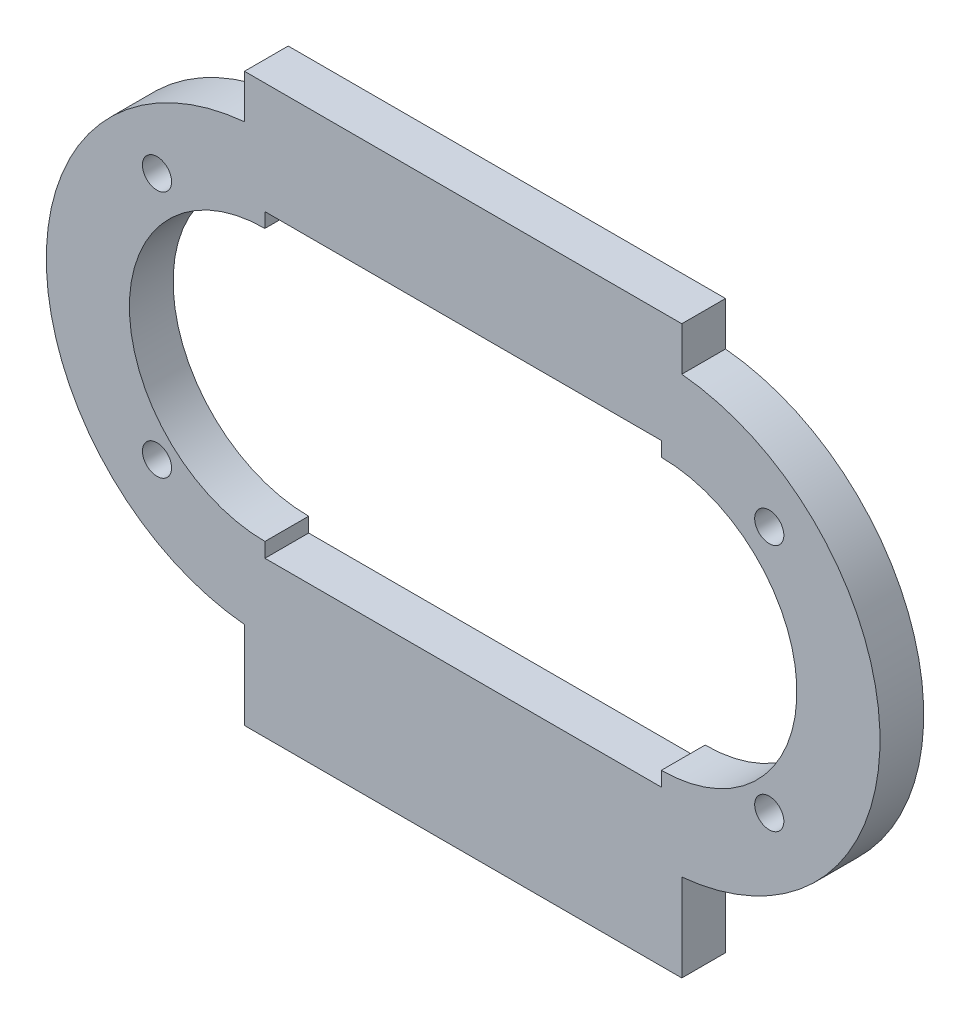
ISO-10303-21;
HEADER;
FILE_DESCRIPTION(('STEP AP214'),'2;1');
FILE_NAME('part.step','',(''),(''),'','','');
FILE_SCHEMA(('AUTOMOTIVE_DESIGN { 1 0 10303 214 1 1 1 1 }'));
ENDSEC;
DATA;
#1=APPLICATION_CONTEXT('core data for automotive mechanical design processes');
#2=APPLICATION_PROTOCOL_DEFINITION('international standard','automotive_design',2000,#1);
#3=PRODUCT_CONTEXT('',#1,'mechanical');
#4=PRODUCT('Part','Part','',(#3));
#5=PRODUCT_RELATED_PRODUCT_CATEGORY('part','',(#4));
#6=PRODUCT_DEFINITION_FORMATION('','',#4);
#7=PRODUCT_DEFINITION_CONTEXT('part definition',#1,'design');
#8=PRODUCT_DEFINITION('design','',#6,#7);
#9=PRODUCT_DEFINITION_SHAPE('','',#8);
#10=(LENGTH_UNIT() NAMED_UNIT(*) SI_UNIT(.MILLI.,.METRE.));
#11=(NAMED_UNIT(*) PLANE_ANGLE_UNIT() SI_UNIT($,.RADIAN.));
#12=(NAMED_UNIT(*) SI_UNIT($,.STERADIAN.) SOLID_ANGLE_UNIT());
#13=UNCERTAINTY_MEASURE_WITH_UNIT(LENGTH_MEASURE(1.E-05),#10,'distance_accuracy_value','');
#14=(GEOMETRIC_REPRESENTATION_CONTEXT(3) GLOBAL_UNCERTAINTY_ASSIGNED_CONTEXT((#13)) GLOBAL_UNIT_ASSIGNED_CONTEXT((#10,
#11,#12)) REPRESENTATION_CONTEXT('',''));
#15=CARTESIAN_POINT('',(0.,0.,0.));
#16=DIRECTION('',(0.,0.,1.));
#17=DIRECTION('',(1.,0.,0.));
#18=AXIS2_PLACEMENT_3D('',#15,#16,#17);
#19=CARTESIAN_POINT('',(27.1936662606577,0.,3.));
#20=DIRECTION('',(0.,0.,-1.));
#21=DIRECTION('',(-1.,0.,0.));
#22=AXIS2_PLACEMENT_3D('',#19,#20,#21);
#23=PLANE('',#22);
#24=DIRECTION('',(1.,0.,0.));
#25=VECTOR('',#24,1.);
#26=CARTESIAN_POINT('',(-1.40316686967113,-20.9342265529842,3.));
#27=LINE('',#26,#25);
#28=CARTESIAN_POINT('',(-1.40316686967113,-20.9342265529842,3.));
#29=VERTEX_POINT('',#28);
#30=CARTESIAN_POINT('',(28.5968331303289,-20.9342265529842,3.));
#31=VERTEX_POINT('',#30);
#32=EDGE_CURVE('E245',#29,#31,#27,.T.);
#33=ORIENTED_EDGE('',*,*,#32,.T.);
#34=DIRECTION('',(0.,1.,0.));
#35=VECTOR('',#34,1.);
#36=CARTESIAN_POINT('',(28.5968331303289,-20.9342265529842,3.));
#37=LINE('',#36,#35);
#38=CARTESIAN_POINT('',(28.5968331303289,-14.9342265529842,3.));
#39=VERTEX_POINT('',#38);
#40=EDGE_CURVE('E249',#31,#39,#37,.T.);
#41=ORIENTED_EDGE('',*,*,#40,.T.);
#42=CARTESIAN_POINT('',(27.1936662606577,0.,3.));
#43=DIRECTION('',(0.,0.,1.));
#44=DIRECTION('',(-1.,0.,0.));
#45=AXIS2_PLACEMENT_3D('',#42,#43,#44);
#46=CIRCLE('',#45,15.);
#47=CARTESIAN_POINT('',(28.5968331303289,14.9342265529842,3.));
#48=VERTEX_POINT('',#47);
#49=EDGE_CURVE('E253',#39,#48,#46,.T.);
#50=ORIENTED_EDGE('',*,*,#49,.T.);
#51=DIRECTION('',(0.,1.,0.));
#52=VECTOR('',#51,1.);
#53=CARTESIAN_POINT('',(28.5968331303289,17.9342265529842,3.));
#54=LINE('',#53,#52);
#55=CARTESIAN_POINT('',(28.5968331303289,17.9342265529842,3.));
#56=VERTEX_POINT('',#55);
#57=EDGE_CURVE('E256',#48,#56,#54,.T.);
#58=ORIENTED_EDGE('',*,*,#57,.T.);
#59=DIRECTION('',(-1.,0.,0.));
#60=VECTOR('',#59,1.);
#61=CARTESIAN_POINT('',(-1.40316686967113,17.9342265529842,3.));
#62=LINE('',#61,#60);
#63=CARTESIAN_POINT('',(-1.40316686967113,17.9342265529842,3.));
#64=VERTEX_POINT('',#63);
#65=EDGE_CURVE('E259',#56,#64,#62,.T.);
#66=ORIENTED_EDGE('',*,*,#65,.T.);
#67=DIRECTION('',(0.,-1.,0.));
#68=VECTOR('',#67,1.);
#69=CARTESIAN_POINT('',(-1.40316686967113,17.9342265529842,3.));
#70=LINE('',#69,#68);
#71=CARTESIAN_POINT('',(-1.40316686967113,14.9342265529842,3.));
#72=VERTEX_POINT('',#71);
#73=EDGE_CURVE('E262',#64,#72,#70,.T.);
#74=ORIENTED_EDGE('',*,*,#73,.T.);
#75=CARTESIAN_POINT('',(0.,0.,3.));
#76=DIRECTION('',(0.,0.,1.));
#77=DIRECTION('',(1.,0.,0.));
#78=AXIS2_PLACEMENT_3D('',#75,#76,#77);
#79=CIRCLE('',#78,15.);
#80=CARTESIAN_POINT('',(-1.40316686967113,-14.9342265529842,3.));
#81=VERTEX_POINT('',#80);
#82=EDGE_CURVE('E265',#72,#81,#79,.T.);
#83=ORIENTED_EDGE('',*,*,#82,.T.);
#84=DIRECTION('',(0.,-1.,0.));
#85=VECTOR('',#84,1.);
#86=CARTESIAN_POINT('',(-1.40316686967113,-20.9342265529842,3.));
#87=LINE('',#86,#85);
#88=EDGE_CURVE('E268',#81,#29,#87,.T.);
#89=ORIENTED_EDGE('',*,*,#88,.T.);
#90=EDGE_LOOP('',(#33,#41,#50,#58,#66,#74,#83,#89));
#91=FACE_BOUND('',#90,.T.);
#92=DIRECTION('',(-1.04325473838697E-13,-1.,0.));
#93=VECTOR('',#92,1.);
#94=CARTESIAN_POINT('',(0.,-9.29754169110126,3.));
#95=LINE('',#94,#93);
#96=CARTESIAN_POINT('',(0.,-9.29754169110126,3.));
#97=VERTEX_POINT('',#96);
#98=CARTESIAN_POINT('',(0.,-10.2975416911012,3.));
#99=VERTEX_POINT('',#98);
#100=EDGE_CURVE('E153',#97,#99,#95,.T.);
#101=ORIENTED_EDGE('',*,*,#100,.F.);
#102=CARTESIAN_POINT('',(0.,0.,3.));
#103=DIRECTION('',(0.,0.,1.));
#104=DIRECTION('',(1.,0.,0.));
#105=AXIS2_PLACEMENT_3D('',#102,#103,#104);
#106=CIRCLE('',#105,9.29754169110126);
#107=CARTESIAN_POINT('',(0.,9.29754169110126,3.));
#108=VERTEX_POINT('',#107);
#109=EDGE_CURVE('E196',#108,#97,#106,.T.);
#110=ORIENTED_EDGE('',*,*,#109,.F.);
#111=DIRECTION('',(0.,-1.,0.));
#112=VECTOR('',#111,1.);
#113=CARTESIAN_POINT('',(0.,10.2975416911012,3.));
#114=LINE('',#113,#112);
#115=CARTESIAN_POINT('',(0.,10.2975416911012,3.));
#116=VERTEX_POINT('',#115);
#117=EDGE_CURVE('E193',#116,#108,#114,.T.);
#118=ORIENTED_EDGE('',*,*,#117,.F.);
#119=DIRECTION('',(-1.,0.,0.));
#120=VECTOR('',#119,1.);
#121=CARTESIAN_POINT('',(0.,10.2975416911012,3.));
#122=LINE('',#121,#120);
#123=CARTESIAN_POINT('',(27.1936662606577,10.2975416911012,3.));
#124=VERTEX_POINT('',#123);
#125=EDGE_CURVE('E190',#124,#116,#122,.T.);
#126=ORIENTED_EDGE('',*,*,#125,.F.);
#127=DIRECTION('',(0.,1.,0.));
#128=VECTOR('',#127,1.);
#129=CARTESIAN_POINT('',(27.1936662606577,10.2975416911012,3.));
#130=LINE('',#129,#128);
#131=CARTESIAN_POINT('',(27.1936662606577,9.29754169110125,3.));
#132=VERTEX_POINT('',#131);
#133=EDGE_CURVE('E187',#132,#124,#130,.T.);
#134=ORIENTED_EDGE('',*,*,#133,.F.);
#135=CARTESIAN_POINT('',(27.1936662606577,0.,3.));
#136=DIRECTION('',(0.,0.,1.));
#137=DIRECTION('',(-1.,0.,0.));
#138=AXIS2_PLACEMENT_3D('',#135,#136,#137);
#139=CIRCLE('',#138,9.29754169110125);
#140=CARTESIAN_POINT('',(27.1936662606577,-9.29754169110125,3.));
#141=VERTEX_POINT('',#140);
#142=EDGE_CURVE('E181',#141,#132,#139,.T.);
#143=ORIENTED_EDGE('',*,*,#142,.F.);
#144=DIRECTION('',(0.,1.,0.));
#145=VECTOR('',#144,1.);
#146=CARTESIAN_POINT('',(27.1936662606577,-9.29754169110125,3.));
#147=LINE('',#146,#145);
#148=CARTESIAN_POINT('',(27.1936662606577,-10.2975416911012,3.));
#149=VERTEX_POINT('',#148);
#150=EDGE_CURVE('E177',#149,#141,#147,.T.);
#151=ORIENTED_EDGE('',*,*,#150,.F.);
#152=DIRECTION('',(1.,0.,0.));
#153=VECTOR('',#152,1.);
#154=CARTESIAN_POINT('',(0.,-10.2975416911012,3.));
#155=LINE('',#154,#153);
#156=EDGE_CURVE('E162',#99,#149,#155,.T.);
#157=ORIENTED_EDGE('',*,*,#156,.F.);
#158=EDGE_LOOP('',(#101,#110,#118,#126,#134,#143,#151,#157));
#159=FACE_BOUND('',#158,.T.);
#160=CARTESIAN_POINT('',(-7.40316686967112,8.86737245821573,3.));
#161=DIRECTION('',(0.,0.,1.));
#162=DIRECTION('',(1.,0.,0.));
#163=AXIS2_PLACEMENT_3D('',#160,#161,#162);
#164=CIRCLE('',#163,1.);
#165=CARTESIAN_POINT('',(-6.40316686967112,8.86737245821573,3.));
#166=VERTEX_POINT('',#165);
#167=EDGE_CURVE('E201',#166,#166,#164,.T.);
#168=ORIENTED_EDGE('',*,*,#167,.F.);
#169=EDGE_LOOP('',(#168));
#170=FACE_BOUND('',#169,.T.);
#171=CARTESIAN_POINT('',(34.5968331303289,8.86737245821605,3.));
#172=DIRECTION('',(0.,0.,1.));
#173=DIRECTION('',(1.,0.,0.));
#174=AXIS2_PLACEMENT_3D('',#171,#172,#173);
#175=CIRCLE('',#174,1.00000000000001);
#176=CARTESIAN_POINT('',(35.5968331303289,8.86737245821605,3.));
#177=VERTEX_POINT('',#176);
#178=EDGE_CURVE('E450',#177,#177,#175,.T.);
#179=ORIENTED_EDGE('',*,*,#178,.F.);
#180=EDGE_LOOP('',(#179));
#181=FACE_BOUND('',#180,.T.);
#182=CARTESIAN_POINT('',(34.5968331303289,-8.13262754178395,3.));
#183=DIRECTION('',(0.,0.,1.));
#184=DIRECTION('',(1.,0.,0.));
#185=AXIS2_PLACEMENT_3D('',#182,#183,#184);
#186=CIRCLE('',#185,1.00000000000001);
#187=CARTESIAN_POINT('',(35.5968331303289,-8.13262754178395,3.));
#188=VERTEX_POINT('',#187);
#189=EDGE_CURVE('E442',#188,#188,#186,.T.);
#190=ORIENTED_EDGE('',*,*,#189,.F.);
#191=EDGE_LOOP('',(#190));
#192=FACE_BOUND('',#191,.T.);
#193=CARTESIAN_POINT('',(-7.40316686967112,-8.13262754178368,3.));
#194=DIRECTION('',(0.,0.,1.));
#195=DIRECTION('',(1.,0.,0.));
#196=AXIS2_PLACEMENT_3D('',#193,#194,#195);
#197=CIRCLE('',#196,1.);
#198=CARTESIAN_POINT('',(-6.40316686967112,-8.13262754178368,3.));
#199=VERTEX_POINT('',#198);
#200=EDGE_CURVE('E431',#199,#199,#197,.T.);
#201=ORIENTED_EDGE('',*,*,#200,.F.);
#202=EDGE_LOOP('',(#201));
#203=FACE_BOUND('',#202,.T.);
#204=ADVANCED_FACE('F39',(#91,#159,#170,#181,#192,#203),#23,.F.);
#205=CARTESIAN_POINT('',(27.1936662606577,0.,0.));
#206=DIRECTION('',(0.,0.,-1.));
#207=DIRECTION('',(-1.,0.,0.));
#208=AXIS2_PLACEMENT_3D('',#205,#206,#207);
#209=PLANE('',#208);
#210=CARTESIAN_POINT('',(34.5968331303289,-8.13262754178395,0.));
#211=DIRECTION('',(0.,0.,1.));
#212=DIRECTION('',(1.,0.,0.));
#213=AXIS2_PLACEMENT_3D('',#210,#211,#212);
#214=CIRCLE('',#213,1.00000000000001);
#215=CARTESIAN_POINT('',(35.5968331303289,-8.13262754178395,0.));
#216=VERTEX_POINT('',#215);
#217=EDGE_CURVE('E439',#216,#216,#214,.T.);
#218=ORIENTED_EDGE('',*,*,#217,.T.);
#219=EDGE_LOOP('',(#218));
#220=FACE_BOUND('',#219,.T.);
#221=CARTESIAN_POINT('',(-7.40316686967112,8.86737245821573,0.));
#222=DIRECTION('',(0.,0.,1.));
#223=DIRECTION('',(1.,0.,0.));
#224=AXIS2_PLACEMENT_3D('',#221,#222,#223);
#225=CIRCLE('',#224,1.);
#226=CARTESIAN_POINT('',(-6.40316686967112,8.86737245821573,0.));
#227=VERTEX_POINT('',#226);
#228=EDGE_CURVE('E454',#227,#227,#225,.T.);
#229=ORIENTED_EDGE('',*,*,#228,.T.);
#230=EDGE_LOOP('',(#229));
#231=FACE_BOUND('',#230,.T.);
#232=DIRECTION('',(1.,0.,0.));
#233=VECTOR('',#232,1.);
#234=CARTESIAN_POINT('',(-1.40316686967113,-20.9342265529842,0.));
#235=LINE('',#234,#233);
#236=CARTESIAN_POINT('',(-1.40316686967113,-20.9342265529842,0.));
#237=VERTEX_POINT('',#236);
#238=CARTESIAN_POINT('',(28.5968331303289,-20.9342265529842,0.));
#239=VERTEX_POINT('',#238);
#240=EDGE_CURVE('E171',#237,#239,#235,.T.);
#241=ORIENTED_EDGE('',*,*,#240,.F.);
#242=DIRECTION('',(0.,-1.,0.));
#243=VECTOR('',#242,1.);
#244=CARTESIAN_POINT('',(-1.40316686967113,-20.9342265529842,0.));
#245=LINE('',#244,#243);
#246=CARTESIAN_POINT('',(-1.40316686967113,-14.9342265529842,0.));
#247=VERTEX_POINT('',#246);
#248=EDGE_CURVE('E250',#247,#237,#245,.T.);
#249=ORIENTED_EDGE('',*,*,#248,.F.);
#250=CARTESIAN_POINT('',(0.,0.,0.));
#251=DIRECTION('',(0.,0.,1.));
#252=DIRECTION('',(1.,0.,0.));
#253=AXIS2_PLACEMENT_3D('',#250,#251,#252);
#254=CIRCLE('',#253,15.);
#255=CARTESIAN_POINT('',(-1.40316686967113,14.9342265529842,0.));
#256=VERTEX_POINT('',#255);
#257=EDGE_CURVE('E290',#256,#247,#254,.T.);
#258=ORIENTED_EDGE('',*,*,#257,.F.);
#259=DIRECTION('',(0.,-1.,0.));
#260=VECTOR('',#259,1.);
#261=CARTESIAN_POINT('',(-1.40316686967113,17.9342265529842,0.));
#262=LINE('',#261,#260);
#263=CARTESIAN_POINT('',(-1.40316686967113,17.9342265529842,0.));
#264=VERTEX_POINT('',#263);
#265=EDGE_CURVE('E287',#264,#256,#262,.T.);
#266=ORIENTED_EDGE('',*,*,#265,.F.);
#267=DIRECTION('',(-1.,0.,0.));
#268=VECTOR('',#267,1.);
#269=CARTESIAN_POINT('',(-1.40316686967113,17.9342265529842,0.));
#270=LINE('',#269,#268);
#271=CARTESIAN_POINT('',(28.5968331303289,17.9342265529842,0.));
#272=VERTEX_POINT('',#271);
#273=EDGE_CURVE('E284',#272,#264,#270,.T.);
#274=ORIENTED_EDGE('',*,*,#273,.F.);
#275=DIRECTION('',(0.,1.,0.));
#276=VECTOR('',#275,1.);
#277=CARTESIAN_POINT('',(28.5968331303289,17.9342265529842,0.));
#278=LINE('',#277,#276);
#279=CARTESIAN_POINT('',(28.5968331303289,14.9342265529842,0.));
#280=VERTEX_POINT('',#279);
#281=EDGE_CURVE('E281',#280,#272,#278,.T.);
#282=ORIENTED_EDGE('',*,*,#281,.F.);
#283=CARTESIAN_POINT('',(27.1936662606577,0.,0.));
#284=DIRECTION('',(0.,0.,1.));
#285=DIRECTION('',(-1.,0.,0.));
#286=AXIS2_PLACEMENT_3D('',#283,#284,#285);
#287=CIRCLE('',#286,15.);
#288=CARTESIAN_POINT('',(28.5968331303289,-14.9342265529842,0.));
#289=VERTEX_POINT('',#288);
#290=EDGE_CURVE('E278',#289,#280,#287,.T.);
#291=ORIENTED_EDGE('',*,*,#290,.F.);
#292=DIRECTION('',(0.,1.,0.));
#293=VECTOR('',#292,1.);
#294=CARTESIAN_POINT('',(28.5968331303289,-20.9342265529842,0.));
#295=LINE('',#294,#293);
#296=EDGE_CURVE('E275',#239,#289,#295,.T.);
#297=ORIENTED_EDGE('',*,*,#296,.F.);
#298=EDGE_LOOP('',(#241,#249,#258,#266,#274,#282,#291,#297));
#299=FACE_BOUND('',#298,.T.);
#300=CARTESIAN_POINT('',(0.,0.,0.));
#301=DIRECTION('',(0.,0.,1.));
#302=DIRECTION('',(1.,0.,0.));
#303=AXIS2_PLACEMENT_3D('',#300,#301,#302);
#304=CIRCLE('',#303,9.29754169110126);
#305=CARTESIAN_POINT('',(0.,9.29754169110126,0.));
#306=VERTEX_POINT('',#305);
#307=CARTESIAN_POINT('',(0.,-9.29754169110126,0.));
#308=VERTEX_POINT('',#307);
#309=EDGE_CURVE('E163',#306,#308,#304,.T.);
#310=ORIENTED_EDGE('',*,*,#309,.T.);
#311=DIRECTION('',(-1.04325473838697E-13,-1.,0.));
#312=VECTOR('',#311,1.);
#313=CARTESIAN_POINT('',(0.,-9.29754169110126,0.));
#314=LINE('',#313,#312);
#315=CARTESIAN_POINT('',(0.,-10.2975416911012,0.));
#316=VERTEX_POINT('',#315);
#317=EDGE_CURVE('E63',#308,#316,#314,.T.);
#318=ORIENTED_EDGE('',*,*,#317,.T.);
#319=DIRECTION('',(1.,0.,0.));
#320=VECTOR('',#319,1.);
#321=CARTESIAN_POINT('',(0.,-10.2975416911012,0.));
#322=LINE('',#321,#320);
#323=CARTESIAN_POINT('',(27.1936662606577,-10.2975416911012,0.));
#324=VERTEX_POINT('',#323);
#325=EDGE_CURVE('E169',#316,#324,#322,.T.);
#326=ORIENTED_EDGE('',*,*,#325,.T.);
#327=DIRECTION('',(0.,1.,0.));
#328=VECTOR('',#327,1.);
#329=CARTESIAN_POINT('',(27.1936662606577,-9.29754169110125,0.));
#330=LINE('',#329,#328);
#331=CARTESIAN_POINT('',(27.1936662606577,-9.29754169110125,0.));
#332=VERTEX_POINT('',#331);
#333=EDGE_CURVE('E204',#324,#332,#330,.T.);
#334=ORIENTED_EDGE('',*,*,#333,.T.);
#335=CARTESIAN_POINT('',(27.1936662606577,0.,0.));
#336=DIRECTION('',(0.,0.,1.));
#337=DIRECTION('',(-1.,0.,0.));
#338=AXIS2_PLACEMENT_3D('',#335,#336,#337);
#339=CIRCLE('',#338,9.29754169110125);
#340=CARTESIAN_POINT('',(27.1936662606577,9.29754169110125,0.));
#341=VERTEX_POINT('',#340);
#342=EDGE_CURVE('E208',#332,#341,#339,.T.);
#343=ORIENTED_EDGE('',*,*,#342,.T.);
#344=DIRECTION('',(0.,1.,0.));
#345=VECTOR('',#344,1.);
#346=CARTESIAN_POINT('',(27.1936662606577,10.2975416911012,0.));
#347=LINE('',#346,#345);
#348=CARTESIAN_POINT('',(27.1936662606577,10.2975416911012,0.));
#349=VERTEX_POINT('',#348);
#350=EDGE_CURVE('E212',#341,#349,#347,.T.);
#351=ORIENTED_EDGE('',*,*,#350,.T.);
#352=DIRECTION('',(-1.,0.,0.));
#353=VECTOR('',#352,1.);
#354=CARTESIAN_POINT('',(0.,10.2975416911012,0.));
#355=LINE('',#354,#353);
#356=CARTESIAN_POINT('',(0.,10.2975416911012,0.));
#357=VERTEX_POINT('',#356);
#358=EDGE_CURVE('E216',#349,#357,#355,.T.);
#359=ORIENTED_EDGE('',*,*,#358,.T.);
#360=DIRECTION('',(0.,-1.,0.));
#361=VECTOR('',#360,1.);
#362=CARTESIAN_POINT('',(0.,10.2975416911012,0.));
#363=LINE('',#362,#361);
#364=EDGE_CURVE('E220',#357,#306,#363,.T.);
#365=ORIENTED_EDGE('',*,*,#364,.T.);
#366=EDGE_LOOP('',(#310,#318,#326,#334,#343,#351,#359,#365));
#367=FACE_BOUND('',#366,.T.);
#368=CARTESIAN_POINT('',(34.5968331303289,8.86737245821605,0.));
#369=DIRECTION('',(0.,0.,1.));
#370=DIRECTION('',(1.,0.,0.));
#371=AXIS2_PLACEMENT_3D('',#368,#369,#370);
#372=CIRCLE('',#371,1.00000000000001);
#373=CARTESIAN_POINT('',(35.5968331303289,8.86737245821605,0.));
#374=VERTEX_POINT('',#373);
#375=EDGE_CURVE('E446',#374,#374,#372,.T.);
#376=ORIENTED_EDGE('',*,*,#375,.T.);
#377=EDGE_LOOP('',(#376));
#378=FACE_BOUND('',#377,.T.);
#379=CARTESIAN_POINT('',(-7.40316686967112,-8.13262754178368,0.));
#380=DIRECTION('',(0.,0.,1.));
#381=DIRECTION('',(1.,0.,0.));
#382=AXIS2_PLACEMENT_3D('',#379,#380,#381);
#383=CIRCLE('',#382,1.);
#384=CARTESIAN_POINT('',(-6.40316686967112,-8.13262754178368,0.));
#385=VERTEX_POINT('',#384);
#386=EDGE_CURVE('E434',#385,#385,#383,.T.);
#387=ORIENTED_EDGE('',*,*,#386,.T.);
#388=EDGE_LOOP('',(#387));
#389=FACE_BOUND('',#388,.T.);
#390=ADVANCED_FACE('F329',(#220,#231,#299,#367,#378,#389),#209,.T.);
#391=CARTESIAN_POINT('',(-1.40316686967113,-20.9342265529842,3.));
#392=DIRECTION('',(0.,1.,0.));
#393=DIRECTION('',(0.,0.,1.));
#394=AXIS2_PLACEMENT_3D('',#391,#392,#393);
#395=PLANE('',#394);
#396=ORIENTED_EDGE('',*,*,#240,.T.);
#397=DIRECTION('',(0.,0.,-1.));
#398=VECTOR('',#397,1.);
#399=CARTESIAN_POINT('',(28.5968331303289,-20.9342265529842,3.));
#400=LINE('',#399,#398);
#401=EDGE_CURVE('E11',#31,#239,#400,.T.);
#402=ORIENTED_EDGE('',*,*,#401,.F.);
#403=ORIENTED_EDGE('',*,*,#32,.F.);
#404=DIRECTION('',(0.,0.,-1.));
#405=VECTOR('',#404,1.);
#406=CARTESIAN_POINT('',(-1.40316686967113,-20.9342265529842,3.));
#407=LINE('',#406,#405);
#408=EDGE_CURVE('E271',#29,#237,#407,.T.);
#409=ORIENTED_EDGE('',*,*,#408,.T.);
#410=EDGE_LOOP('',(#396,#402,#403,#409));
#411=FACE_BOUND('',#410,.T.);
#412=ADVANCED_FACE('F41',(#411),#395,.F.);
#413=CARTESIAN_POINT('',(28.5968331303289,-20.9342265529842,3.));
#414=DIRECTION('',(-1.,0.,0.));
#415=DIRECTION('',(0.,-1.,0.));
#416=AXIS2_PLACEMENT_3D('',#413,#414,#415);
#417=PLANE('',#416);
#418=ORIENTED_EDGE('',*,*,#296,.T.);
#419=DIRECTION('',(0.,0.,-1.));
#420=VECTOR('',#419,1.);
#421=CARTESIAN_POINT('',(28.5968331303289,-14.9342265529842,3.));
#422=LINE('',#421,#420);
#423=EDGE_CURVE('E48',#39,#289,#422,.T.);
#424=ORIENTED_EDGE('',*,*,#423,.F.);
#425=ORIENTED_EDGE('',*,*,#40,.F.);
#426=ORIENTED_EDGE('',*,*,#401,.T.);
#427=EDGE_LOOP('',(#418,#424,#425,#426));
#428=FACE_BOUND('',#427,.T.);
#429=ADVANCED_FACE('F346',(#428),#417,.F.);
#430=CARTESIAN_POINT('',(27.1936662606577,0.,3.));
#431=DIRECTION('',(0.,0.,-1.));
#432=DIRECTION('',(-1.,0.,0.));
#433=AXIS2_PLACEMENT_3D('',#430,#431,#432);
#434=CYLINDRICAL_SURFACE('',#433,15.);
#435=ORIENTED_EDGE('',*,*,#290,.T.);
#436=DIRECTION('',(0.,0.,-1.));
#437=VECTOR('',#436,1.);
#438=CARTESIAN_POINT('',(28.5968331303289,14.9342265529842,3.));
#439=LINE('',#438,#437);
#440=EDGE_CURVE('E314',#48,#280,#439,.T.);
#441=ORIENTED_EDGE('',*,*,#440,.F.);
#442=ORIENTED_EDGE('',*,*,#49,.F.);
#443=ORIENTED_EDGE('',*,*,#423,.T.);
#444=EDGE_LOOP('',(#435,#441,#442,#443));
#445=FACE_BOUND('',#444,.T.);
#446=ADVANCED_FACE('F323',(#445),#434,.T.);
#447=CARTESIAN_POINT('',(28.5968331303289,17.9342265529842,3.));
#448=DIRECTION('',(-1.,0.,0.));
#449=DIRECTION('',(0.,-1.,0.));
#450=AXIS2_PLACEMENT_3D('',#447,#448,#449);
#451=PLANE('',#450);
#452=ORIENTED_EDGE('',*,*,#281,.T.);
#453=DIRECTION('',(0.,0.,-1.));
#454=VECTOR('',#453,1.);
#455=CARTESIAN_POINT('',(28.5968331303289,17.9342265529842,3.));
#456=LINE('',#455,#454);
#457=EDGE_CURVE('E310',#56,#272,#456,.T.);
#458=ORIENTED_EDGE('',*,*,#457,.F.);
#459=ORIENTED_EDGE('',*,*,#57,.F.);
#460=ORIENTED_EDGE('',*,*,#440,.T.);
#461=EDGE_LOOP('',(#452,#458,#459,#460));
#462=FACE_BOUND('',#461,.T.);
#463=ADVANCED_FACE('F335',(#462),#451,.F.);
#464=CARTESIAN_POINT('',(-1.40316686967113,17.9342265529842,3.));
#465=DIRECTION('',(0.,-1.,0.));
#466=DIRECTION('',(1.,0.,0.));
#467=AXIS2_PLACEMENT_3D('',#464,#465,#466);
#468=PLANE('',#467);
#469=ORIENTED_EDGE('',*,*,#273,.T.);
#470=DIRECTION('',(0.,0.,-1.));
#471=VECTOR('',#470,1.);
#472=CARTESIAN_POINT('',(-1.40316686967113,17.9342265529842,3.));
#473=LINE('',#472,#471);
#474=EDGE_CURVE('E306',#64,#264,#473,.T.);
#475=ORIENTED_EDGE('',*,*,#474,.F.);
#476=ORIENTED_EDGE('',*,*,#65,.F.);
#477=ORIENTED_EDGE('',*,*,#457,.T.);
#478=EDGE_LOOP('',(#469,#475,#476,#477));
#479=FACE_BOUND('',#478,.T.);
#480=ADVANCED_FACE('F339',(#479),#468,.F.);
#481=CARTESIAN_POINT('',(-1.40316686967113,17.9342265529842,3.));
#482=DIRECTION('',(1.,0.,0.));
#483=DIRECTION('',(0.,1.,0.));
#484=AXIS2_PLACEMENT_3D('',#481,#482,#483);
#485=PLANE('',#484);
#486=ORIENTED_EDGE('',*,*,#265,.T.);
#487=DIRECTION('',(0.,0.,-1.));
#488=VECTOR('',#487,1.);
#489=CARTESIAN_POINT('',(-1.40316686967113,14.9342265529842,3.));
#490=LINE('',#489,#488);
#491=EDGE_CURVE('E302',#72,#256,#490,.T.);
#492=ORIENTED_EDGE('',*,*,#491,.F.);
#493=ORIENTED_EDGE('',*,*,#73,.F.);
#494=ORIENTED_EDGE('',*,*,#474,.T.);
#495=EDGE_LOOP('',(#486,#492,#493,#494));
#496=FACE_BOUND('',#495,.T.);
#497=ADVANCED_FACE('F359',(#496),#485,.F.);
#498=CARTESIAN_POINT('',(0.,0.,3.));
#499=DIRECTION('',(0.,0.,-1.));
#500=DIRECTION('',(-1.,0.,0.));
#501=AXIS2_PLACEMENT_3D('',#498,#499,#500);
#502=CYLINDRICAL_SURFACE('',#501,15.);
#503=ORIENTED_EDGE('',*,*,#257,.T.);
#504=DIRECTION('',(0.,0.,-1.));
#505=VECTOR('',#504,1.);
#506=CARTESIAN_POINT('',(-1.40316686967113,-14.9342265529842,3.));
#507=LINE('',#506,#505);
#508=EDGE_CURVE('E298',#81,#247,#507,.T.);
#509=ORIENTED_EDGE('',*,*,#508,.F.);
#510=ORIENTED_EDGE('',*,*,#82,.F.);
#511=ORIENTED_EDGE('',*,*,#491,.T.);
#512=EDGE_LOOP('',(#503,#509,#510,#511));
#513=FACE_BOUND('',#512,.T.);
#514=ADVANCED_FACE('F357',(#513),#502,.T.);
#515=CARTESIAN_POINT('',(-1.40316686967113,-20.9342265529842,3.));
#516=DIRECTION('',(1.,0.,0.));
#517=DIRECTION('',(0.,0.,-1.));
#518=AXIS2_PLACEMENT_3D('',#515,#516,#517);
#519=PLANE('',#518);
#520=ORIENTED_EDGE('',*,*,#248,.T.);
#521=ORIENTED_EDGE('',*,*,#408,.F.);
#522=ORIENTED_EDGE('',*,*,#88,.F.);
#523=ORIENTED_EDGE('',*,*,#508,.T.);
#524=EDGE_LOOP('',(#520,#521,#522,#523));
#525=FACE_BOUND('',#524,.T.);
#526=ADVANCED_FACE('F352',(#525),#519,.F.);
#527=CARTESIAN_POINT('',(0.,-9.29754169110126,3.));
#528=DIRECTION('',(1.,-1.04325473838697E-13,0.));
#529=DIRECTION('',(1.04325473838697E-13,1.,0.));
#530=AXIS2_PLACEMENT_3D('',#527,#528,#529);
#531=PLANE('',#530);
#532=ORIENTED_EDGE('',*,*,#317,.F.);
#533=DIRECTION('',(0.,0.,-1.));
#534=VECTOR('',#533,1.);
#535=CARTESIAN_POINT('',(0.,-9.29754169110126,3.));
#536=LINE('',#535,#534);
#537=EDGE_CURVE('E157',#97,#308,#536,.T.);
#538=ORIENTED_EDGE('',*,*,#537,.F.);
#539=ORIENTED_EDGE('',*,*,#100,.T.);
#540=DIRECTION('',(0.,0.,-1.));
#541=VECTOR('',#540,1.);
#542=CARTESIAN_POINT('',(0.,-10.2975416911012,3.));
#543=LINE('',#542,#541);
#544=EDGE_CURVE('E156',#99,#316,#543,.T.);
#545=ORIENTED_EDGE('',*,*,#544,.T.);
#546=EDGE_LOOP('',(#532,#538,#539,#545));
#547=FACE_BOUND('',#546,.T.);
#548=ADVANCED_FACE('F155',(#547),#531,.T.);
#549=CARTESIAN_POINT('',(0.,-10.2975416911012,3.));
#550=DIRECTION('',(0.,1.,0.));
#551=DIRECTION('',(-1.,0.,0.));
#552=AXIS2_PLACEMENT_3D('',#549,#550,#551);
#553=PLANE('',#552);
#554=ORIENTED_EDGE('',*,*,#325,.F.);
#555=ORIENTED_EDGE('',*,*,#544,.F.);
#556=ORIENTED_EDGE('',*,*,#156,.T.);
#557=DIRECTION('',(0.,0.,-1.));
#558=VECTOR('',#557,1.);
#559=CARTESIAN_POINT('',(27.1936662606577,-10.2975416911012,3.));
#560=LINE('',#559,#558);
#561=EDGE_CURVE('E172',#149,#324,#560,.T.);
#562=ORIENTED_EDGE('',*,*,#561,.T.);
#563=EDGE_LOOP('',(#554,#555,#556,#562));
#564=FACE_BOUND('',#563,.T.);
#565=ADVANCED_FACE('F166',(#564),#553,.T.);
#566=CARTESIAN_POINT('',(27.1936662606577,-9.29754169110125,3.));
#567=DIRECTION('',(-1.,0.,0.));
#568=DIRECTION('',(0.,-1.,0.));
#569=AXIS2_PLACEMENT_3D('',#566,#567,#568);
#570=PLANE('',#569);
#571=ORIENTED_EDGE('',*,*,#333,.F.);
#572=ORIENTED_EDGE('',*,*,#561,.F.);
#573=ORIENTED_EDGE('',*,*,#150,.T.);
#574=DIRECTION('',(0.,0.,-1.));
#575=VECTOR('',#574,1.);
#576=CARTESIAN_POINT('',(27.1936662606577,-9.29754169110125,3.));
#577=LINE('',#576,#575);
#578=EDGE_CURVE('E240',#141,#332,#577,.T.);
#579=ORIENTED_EDGE('',*,*,#578,.T.);
#580=EDGE_LOOP('',(#571,#572,#573,#579));
#581=FACE_BOUND('',#580,.T.);
#582=ADVANCED_FACE('F385',(#581),#570,.T.);
#583=CARTESIAN_POINT('',(27.1936662606577,0.,3.));
#584=DIRECTION('',(0.,0.,-1.));
#585=DIRECTION('',(-1.,0.,0.));
#586=AXIS2_PLACEMENT_3D('',#583,#584,#585);
#587=CYLINDRICAL_SURFACE('',#586,9.29754169110125);
#588=ORIENTED_EDGE('',*,*,#342,.F.);
#589=ORIENTED_EDGE('',*,*,#578,.F.);
#590=ORIENTED_EDGE('',*,*,#142,.T.);
#591=DIRECTION('',(0.,0.,-1.));
#592=VECTOR('',#591,1.);
#593=CARTESIAN_POINT('',(27.1936662606577,9.29754169110125,3.));
#594=LINE('',#593,#592);
#595=EDGE_CURVE('E237',#132,#341,#594,.T.);
#596=ORIENTED_EDGE('',*,*,#595,.T.);
#597=EDGE_LOOP('',(#588,#589,#590,#596));
#598=FACE_BOUND('',#597,.T.);
#599=ADVANCED_FACE('F389',(#598),#587,.F.);
#600=CARTESIAN_POINT('',(27.1936662606577,10.2975416911012,3.));
#601=DIRECTION('',(-1.,0.,0.));
#602=DIRECTION('',(0.,-1.,0.));
#603=AXIS2_PLACEMENT_3D('',#600,#601,#602);
#604=PLANE('',#603);
#605=ORIENTED_EDGE('',*,*,#350,.F.);
#606=ORIENTED_EDGE('',*,*,#595,.F.);
#607=ORIENTED_EDGE('',*,*,#133,.T.);
#608=DIRECTION('',(0.,0.,-1.));
#609=VECTOR('',#608,1.);
#610=CARTESIAN_POINT('',(27.1936662606577,10.2975416911012,3.));
#611=LINE('',#610,#609);
#612=EDGE_CURVE('E234',#124,#349,#611,.T.);
#613=ORIENTED_EDGE('',*,*,#612,.T.);
#614=EDGE_LOOP('',(#605,#606,#607,#613));
#615=FACE_BOUND('',#614,.T.);
#616=ADVANCED_FACE('F395',(#615),#604,.T.);
#617=CARTESIAN_POINT('',(0.,10.2975416911012,3.));
#618=DIRECTION('',(0.,-1.,0.));
#619=DIRECTION('',(0.,0.,-1.));
#620=AXIS2_PLACEMENT_3D('',#617,#618,#619);
#621=PLANE('',#620);
#622=ORIENTED_EDGE('',*,*,#358,.F.);
#623=ORIENTED_EDGE('',*,*,#612,.F.);
#624=ORIENTED_EDGE('',*,*,#125,.T.);
#625=DIRECTION('',(0.,0.,-1.));
#626=VECTOR('',#625,1.);
#627=CARTESIAN_POINT('',(0.,10.2975416911012,3.));
#628=LINE('',#627,#626);
#629=EDGE_CURVE('E231',#116,#357,#628,.T.);
#630=ORIENTED_EDGE('',*,*,#629,.T.);
#631=EDGE_LOOP('',(#622,#623,#624,#630));
#632=FACE_BOUND('',#631,.T.);
#633=ADVANCED_FACE('F399',(#632),#621,.T.);
#634=CARTESIAN_POINT('',(0.,10.2975416911012,3.));
#635=DIRECTION('',(1.,0.,0.));
#636=DIRECTION('',(0.,1.,0.));
#637=AXIS2_PLACEMENT_3D('',#634,#635,#636);
#638=PLANE('',#637);
#639=ORIENTED_EDGE('',*,*,#364,.F.);
#640=ORIENTED_EDGE('',*,*,#629,.F.);
#641=ORIENTED_EDGE('',*,*,#117,.T.);
#642=DIRECTION('',(0.,0.,-1.));
#643=VECTOR('',#642,1.);
#644=CARTESIAN_POINT('',(0.,9.29754169110126,3.));
#645=LINE('',#644,#643);
#646=EDGE_CURVE('E55',#108,#306,#645,.T.);
#647=ORIENTED_EDGE('',*,*,#646,.T.);
#648=EDGE_LOOP('',(#639,#640,#641,#647));
#649=FACE_BOUND('',#648,.T.);
#650=ADVANCED_FACE('F403',(#649),#638,.T.);
#651=CARTESIAN_POINT('',(0.,0.,3.));
#652=DIRECTION('',(0.,0.,-1.));
#653=DIRECTION('',(-1.,0.,0.));
#654=AXIS2_PLACEMENT_3D('',#651,#652,#653);
#655=CYLINDRICAL_SURFACE('',#654,9.29754169110126);
#656=ORIENTED_EDGE('',*,*,#309,.F.);
#657=ORIENTED_EDGE('',*,*,#646,.F.);
#658=ORIENTED_EDGE('',*,*,#109,.T.);
#659=ORIENTED_EDGE('',*,*,#537,.T.);
#660=EDGE_LOOP('',(#656,#657,#658,#659));
#661=FACE_BOUND('',#660,.T.);
#662=ADVANCED_FACE('F407',(#661),#655,.F.);
#663=CARTESIAN_POINT('',(-7.40316686967112,8.86737245821573,3.));
#664=DIRECTION('',(0.,0.,-1.));
#665=DIRECTION('',(-1.,0.,0.));
#666=AXIS2_PLACEMENT_3D('',#663,#664,#665);
#667=CYLINDRICAL_SURFACE('',#666,1.);
#668=ORIENTED_EDGE('',*,*,#167,.T.);
#669=EDGE_LOOP('',(#668));
#670=FACE_BOUND('',#669,.T.);
#671=ORIENTED_EDGE('',*,*,#228,.F.);
#672=EDGE_LOOP('',(#671));
#673=FACE_BOUND('',#672,.T.);
#674=ADVANCED_FACE('F411',(#670,#673),#667,.F.);
#675=CARTESIAN_POINT('',(34.5968331303289,8.86737245821605,3.));
#676=DIRECTION('',(0.,0.,-1.));
#677=DIRECTION('',(-1.,0.,0.));
#678=AXIS2_PLACEMENT_3D('',#675,#676,#677);
#679=CYLINDRICAL_SURFACE('',#678,1.00000000000001);
#680=ORIENTED_EDGE('',*,*,#178,.T.);
#681=EDGE_LOOP('',(#680));
#682=FACE_BOUND('',#681,.T.);
#683=ORIENTED_EDGE('',*,*,#375,.F.);
#684=EDGE_LOOP('',(#683));
#685=FACE_BOUND('',#684,.T.);
#686=ADVANCED_FACE('F414',(#682,#685),#679,.F.);
#687=CARTESIAN_POINT('',(34.5968331303289,-8.13262754178395,3.));
#688=DIRECTION('',(0.,0.,-1.));
#689=DIRECTION('',(-1.,0.,0.));
#690=AXIS2_PLACEMENT_3D('',#687,#688,#689);
#691=CYLINDRICAL_SURFACE('',#690,1.00000000000001);
#692=ORIENTED_EDGE('',*,*,#189,.T.);
#693=EDGE_LOOP('',(#692));
#694=FACE_BOUND('',#693,.T.);
#695=ORIENTED_EDGE('',*,*,#217,.F.);
#696=EDGE_LOOP('',(#695));
#697=FACE_BOUND('',#696,.T.);
#698=ADVANCED_FACE('F418',(#694,#697),#691,.F.);
#699=CARTESIAN_POINT('',(-7.40316686967112,-8.13262754178368,3.));
#700=DIRECTION('',(0.,0.,-1.));
#701=DIRECTION('',(-1.,0.,0.));
#702=AXIS2_PLACEMENT_3D('',#699,#700,#701);
#703=CYLINDRICAL_SURFACE('',#702,1.);
#704=ORIENTED_EDGE('',*,*,#200,.T.);
#705=EDGE_LOOP('',(#704));
#706=FACE_BOUND('',#705,.T.);
#707=ORIENTED_EDGE('',*,*,#386,.F.);
#708=EDGE_LOOP('',(#707));
#709=FACE_BOUND('',#708,.T.);
#710=ADVANCED_FACE('F422',(#706,#709),#703,.F.);
#711=CLOSED_SHELL('',(#204,#390,#412,#429,#446,#463,#480,#497,#514,#526,#548,#565,#582,#599,
#616,#633,#650,#662,#674,#686,#698,#710));
#712=MANIFOLD_SOLID_BREP('B2',#711);
#713=ADVANCED_BREP_SHAPE_REPRESENTATION('',(#18,#712),#14);
#714=SHAPE_DEFINITION_REPRESENTATION(#9,#713);
ENDSEC;
END-ISO-10303-21;
